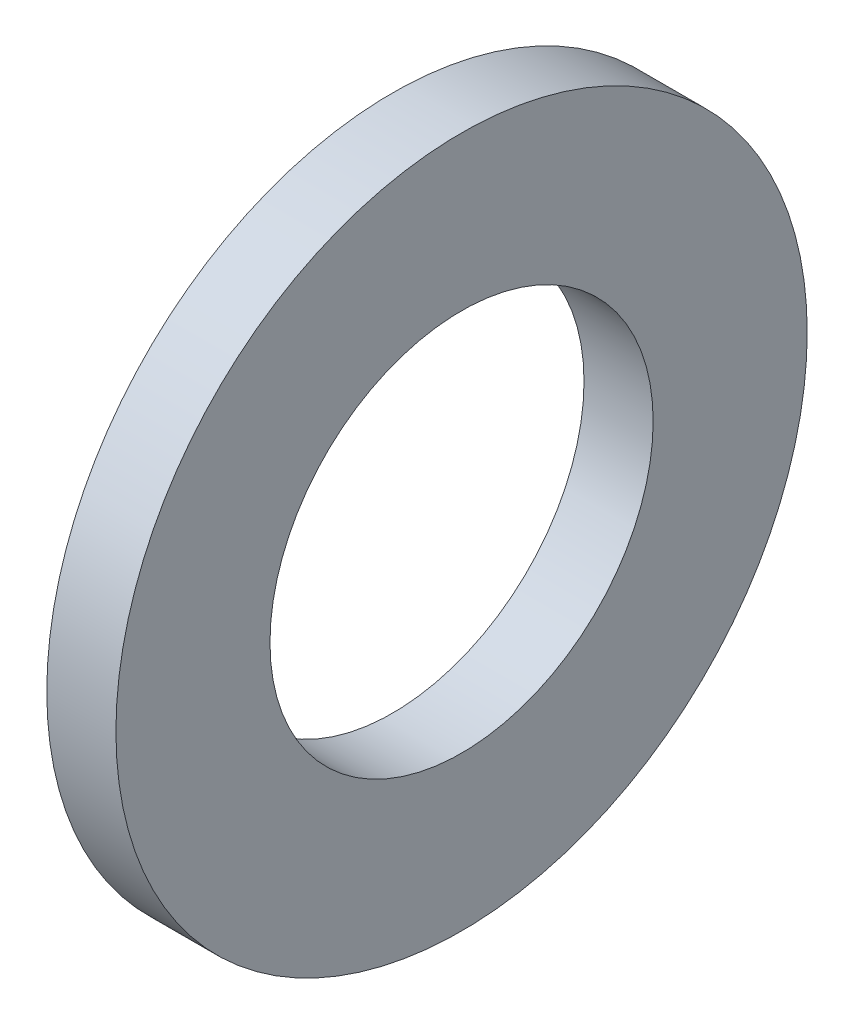
ISO-10303-21;
HEADER;
FILE_DESCRIPTION(('STEP AP214'),'2;1');
FILE_NAME('part.step','',(''),(''),'','','');
FILE_SCHEMA(('AUTOMOTIVE_DESIGN { 1 0 10303 214 1 1 1 1 }'));
ENDSEC;
DATA;
#1=APPLICATION_CONTEXT('core data for automotive mechanical design processes');
#2=APPLICATION_PROTOCOL_DEFINITION('international standard','automotive_design',2000,#1);
#3=PRODUCT_CONTEXT('',#1,'mechanical');
#4=PRODUCT('Part','Part','',(#3));
#5=PRODUCT_RELATED_PRODUCT_CATEGORY('part','',(#4));
#6=PRODUCT_DEFINITION_FORMATION('','',#4);
#7=PRODUCT_DEFINITION_CONTEXT('part definition',#1,'design');
#8=PRODUCT_DEFINITION('design','',#6,#7);
#9=PRODUCT_DEFINITION_SHAPE('','',#8);
#10=(LENGTH_UNIT() NAMED_UNIT(*) SI_UNIT(.MILLI.,.METRE.));
#11=(NAMED_UNIT(*) PLANE_ANGLE_UNIT() SI_UNIT($,.RADIAN.));
#12=(NAMED_UNIT(*) SI_UNIT($,.STERADIAN.) SOLID_ANGLE_UNIT());
#13=UNCERTAINTY_MEASURE_WITH_UNIT(LENGTH_MEASURE(1.E-05),#10,'distance_accuracy_value','');
#14=(GEOMETRIC_REPRESENTATION_CONTEXT(3) GLOBAL_UNCERTAINTY_ASSIGNED_CONTEXT((#13)) GLOBAL_UNIT_ASSIGNED_CONTEXT((#10,
#11,#12)) REPRESENTATION_CONTEXT('',''));
#15=CARTESIAN_POINT('',(0.,0.,0.));
#16=DIRECTION('',(0.,0.,1.));
#17=DIRECTION('',(1.,0.,0.));
#18=AXIS2_PLACEMENT_3D('',#15,#16,#17);
#19=CARTESIAN_POINT('',(-34.9249999999999,0.,0.));
#20=DIRECTION('',(-1.,0.,0.));
#21=DIRECTION('',(0.,0.,1.));
#22=AXIS2_PLACEMENT_3D('',#19,#20,#21);
#23=CYLINDRICAL_SURFACE('',#22,7.76);
#24=CARTESIAN_POINT('',(0.,0.,0.));
#25=DIRECTION('',(-1.,0.,0.));
#26=DIRECTION('',(0.,0.,1.));
#27=AXIS2_PLACEMENT_3D('',#24,#25,#26);
#28=CIRCLE('',#27,7.76);
#29=CARTESIAN_POINT('',(0.,0.,7.76));
#30=VERTEX_POINT('',#29);
#31=EDGE_CURVE('E10',#30,#30,#28,.T.);
#32=ORIENTED_EDGE('',*,*,#31,.F.);
#33=EDGE_LOOP('',(#32));
#34=FACE_BOUND('',#33,.T.);
#35=CARTESIAN_POINT('',(-2.8,0.,0.));
#36=DIRECTION('',(-1.,0.,0.));
#37=DIRECTION('',(0.,0.,1.));
#38=AXIS2_PLACEMENT_3D('',#35,#36,#37);
#39=CIRCLE('',#38,7.76);
#40=CARTESIAN_POINT('',(-2.8,0.,7.76));
#41=VERTEX_POINT('',#40);
#42=EDGE_CURVE('E45',#41,#41,#39,.T.);
#43=ORIENTED_EDGE('',*,*,#42,.T.);
#44=EDGE_LOOP('',(#43));
#45=FACE_BOUND('',#44,.T.);
#46=ADVANCED_FACE('F31',(#34,#45),#23,.F.);
#47=CARTESIAN_POINT('',(0.,7.76,0.));
#48=DIRECTION('',(-1.,0.,0.));
#49=DIRECTION('',(0.,0.,1.));
#50=AXIS2_PLACEMENT_3D('',#47,#48,#49);
#51=PLANE('',#50);
#52=CARTESIAN_POINT('',(0.,0.,0.));
#53=DIRECTION('',(-1.,0.,0.));
#54=DIRECTION('',(0.,0.,1.));
#55=AXIS2_PLACEMENT_3D('',#52,#53,#54);
#56=CIRCLE('',#55,14.);
#57=CARTESIAN_POINT('',(0.,0.,14.));
#58=VERTEX_POINT('',#57);
#59=EDGE_CURVE('E37',#58,#58,#56,.T.);
#60=ORIENTED_EDGE('',*,*,#59,.F.);
#61=EDGE_LOOP('',(#60));
#62=FACE_BOUND('',#61,.T.);
#63=ORIENTED_EDGE('',*,*,#31,.T.);
#64=EDGE_LOOP('',(#63));
#65=FACE_BOUND('',#64,.T.);
#66=ADVANCED_FACE('F60',(#62,#65),#51,.F.);
#67=CARTESIAN_POINT('',(-34.9249999999999,0.,0.));
#68=DIRECTION('',(-1.,0.,0.));
#69=DIRECTION('',(0.,0.,1.));
#70=AXIS2_PLACEMENT_3D('',#67,#68,#69);
#71=CYLINDRICAL_SURFACE('',#70,14.);
#72=CARTESIAN_POINT('',(-2.8,0.,0.));
#73=DIRECTION('',(-1.,0.,0.));
#74=DIRECTION('',(0.,0.,1.));
#75=AXIS2_PLACEMENT_3D('',#72,#73,#74);
#76=CIRCLE('',#75,14.);
#77=CARTESIAN_POINT('',(-2.8,0.,14.));
#78=VERTEX_POINT('',#77);
#79=EDGE_CURVE('E41',#78,#78,#76,.T.);
#80=ORIENTED_EDGE('',*,*,#79,.F.);
#81=EDGE_LOOP('',(#80));
#82=FACE_BOUND('',#81,.T.);
#83=ORIENTED_EDGE('',*,*,#59,.T.);
#84=EDGE_LOOP('',(#83));
#85=FACE_BOUND('',#84,.T.);
#86=ADVANCED_FACE('F55',(#82,#85),#71,.T.);
#87=CARTESIAN_POINT('',(-2.8,14.,0.));
#88=DIRECTION('',(1.,0.,0.));
#89=DIRECTION('',(0.,0.,-1.));
#90=AXIS2_PLACEMENT_3D('',#87,#88,#89);
#91=PLANE('',#90);
#92=ORIENTED_EDGE('',*,*,#42,.F.);
#93=EDGE_LOOP('',(#92));
#94=FACE_BOUND('',#93,.T.);
#95=ORIENTED_EDGE('',*,*,#79,.T.);
#96=EDGE_LOOP('',(#95));
#97=FACE_BOUND('',#96,.T.);
#98=ADVANCED_FACE('F52',(#94,#97),#91,.F.);
#99=CLOSED_SHELL('',(#46,#66,#86,#98));
#100=MANIFOLD_SOLID_BREP('B2',#99);
#101=ADVANCED_BREP_SHAPE_REPRESENTATION('',(#18,#100),#14);
#102=SHAPE_DEFINITION_REPRESENTATION(#9,#101);
ENDSEC;
END-ISO-10303-21;
